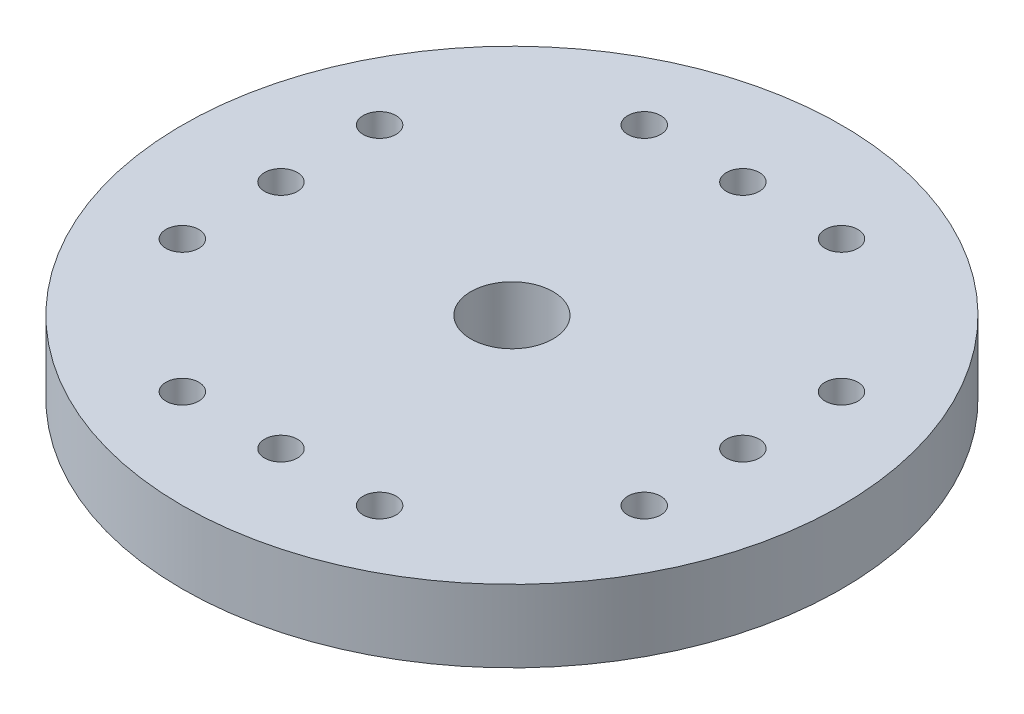
ISO-10303-21;
HEADER;
FILE_DESCRIPTION(('STEP AP214'),'2;1');
FILE_NAME('part.step','',(''),(''),'','','');
FILE_SCHEMA(('AUTOMOTIVE_DESIGN { 1 0 10303 214 1 1 1 1 }'));
ENDSEC;
DATA;
#1=APPLICATION_CONTEXT('core data for automotive mechanical design processes');
#2=APPLICATION_PROTOCOL_DEFINITION('international standard','automotive_design',2000,#1);
#3=PRODUCT_CONTEXT('',#1,'mechanical');
#4=PRODUCT('Part','Part','',(#3));
#5=PRODUCT_RELATED_PRODUCT_CATEGORY('part','',(#4));
#6=PRODUCT_DEFINITION_FORMATION('','',#4);
#7=PRODUCT_DEFINITION_CONTEXT('part definition',#1,'design');
#8=PRODUCT_DEFINITION('design','',#6,#7);
#9=PRODUCT_DEFINITION_SHAPE('','',#8);
#10=(LENGTH_UNIT() NAMED_UNIT(*) SI_UNIT(.MILLI.,.METRE.));
#11=(NAMED_UNIT(*) PLANE_ANGLE_UNIT() SI_UNIT($,.RADIAN.));
#12=(NAMED_UNIT(*) SI_UNIT($,.STERADIAN.) SOLID_ANGLE_UNIT());
#13=UNCERTAINTY_MEASURE_WITH_UNIT(LENGTH_MEASURE(1.E-05),#10,'distance_accuracy_value','');
#14=(GEOMETRIC_REPRESENTATION_CONTEXT(3) GLOBAL_UNCERTAINTY_ASSIGNED_CONTEXT((#13)) GLOBAL_UNIT_ASSIGNED_CONTEXT((#10,
#11,#12)) REPRESENTATION_CONTEXT('',''));
#15=CARTESIAN_POINT('',(0.,0.,0.));
#16=DIRECTION('',(0.,0.,1.));
#17=DIRECTION('',(1.,0.,0.));
#18=AXIS2_PLACEMENT_3D('',#15,#16,#17);
#19=CARTESIAN_POINT('',(0.,2.2,0.));
#20=DIRECTION('',(0.,-1.,0.));
#21=DIRECTION('',(0.,0.,-1.));
#22=AXIS2_PLACEMENT_3D('',#19,#20,#21);
#23=CYLINDRICAL_SURFACE('',#22,10.025);
#24=CARTESIAN_POINT('',(0.,2.2,0.));
#25=DIRECTION('',(0.,1.,0.));
#26=DIRECTION('',(0.,0.,1.));
#27=AXIS2_PLACEMENT_3D('',#24,#25,#26);
#28=CIRCLE('',#27,10.025);
#29=CARTESIAN_POINT('',(0.,2.2,10.025));
#30=VERTEX_POINT('',#29);
#31=EDGE_CURVE('E40',#30,#30,#28,.T.);
#32=ORIENTED_EDGE('',*,*,#31,.F.);
#33=EDGE_LOOP('',(#32));
#34=FACE_BOUND('',#33,.T.);
#35=CARTESIAN_POINT('',(0.,0.,0.));
#36=DIRECTION('',(0.,1.,0.));
#37=DIRECTION('',(0.,0.,1.));
#38=AXIS2_PLACEMENT_3D('',#35,#36,#37);
#39=CIRCLE('',#38,10.025);
#40=CARTESIAN_POINT('',(0.,0.,10.025));
#41=VERTEX_POINT('',#40);
#42=EDGE_CURVE('E44',#41,#41,#39,.T.);
#43=ORIENTED_EDGE('',*,*,#42,.T.);
#44=EDGE_LOOP('',(#43));
#45=FACE_BOUND('',#44,.T.);
#46=ADVANCED_FACE('F34',(#34,#45),#23,.T.);
#47=CARTESIAN_POINT('',(0.,2.2,0.));
#48=DIRECTION('',(0.,1.,0.));
#49=DIRECTION('',(0.,0.,1.));
#50=AXIS2_PLACEMENT_3D('',#47,#48,#49);
#51=PLANE('',#50);
#52=CARTESIAN_POINT('',(0.,2.2,0.));
#53=DIRECTION('',(0.,-1.,0.));
#54=DIRECTION('',(0.,0.,-1.));
#55=AXIS2_PLACEMENT_3D('',#52,#53,#54);
#56=CIRCLE('',#55,1.25);
#57=CARTESIAN_POINT('',(0.,2.2,-1.25));
#58=VERTEX_POINT('',#57);
#59=EDGE_CURVE('E129',#58,#58,#56,.T.);
#60=ORIENTED_EDGE('',*,*,#59,.T.);
#61=EDGE_LOOP('',(#60));
#62=FACE_BOUND('',#61,.T.);
#63=CARTESIAN_POINT('',(-3.00000000000007,2.2,-7.02499999999997));
#64=DIRECTION('',(0.,-1.,0.));
#65=DIRECTION('',(0.,0.,-1.));
#66=AXIS2_PLACEMENT_3D('',#63,#64,#65);
#67=CIRCLE('',#66,0.5);
#68=CARTESIAN_POINT('',(-3.00000000000007,2.2,-7.52499999999997));
#69=VERTEX_POINT('',#68);
#70=EDGE_CURVE('E60',#69,#69,#67,.T.);
#71=ORIENTED_EDGE('',*,*,#70,.T.);
#72=EDGE_LOOP('',(#71));
#73=FACE_BOUND('',#72,.T.);
#74=CARTESIAN_POINT('',(0.,2.2,-7.025));
#75=DIRECTION('',(0.,-1.,0.));
#76=DIRECTION('',(0.,0.,-1.));
#77=AXIS2_PLACEMENT_3D('',#74,#75,#76);
#78=CIRCLE('',#77,0.5);
#79=CARTESIAN_POINT('',(0.,2.2,-7.525));
#80=VERTEX_POINT('',#79);
#81=EDGE_CURVE('E67',#80,#80,#78,.T.);
#82=ORIENTED_EDGE('',*,*,#81,.T.);
#83=EDGE_LOOP('',(#82));
#84=FACE_BOUND('',#83,.T.);
#85=CARTESIAN_POINT('',(2.99999999999993,2.2,-7.02500000000003));
#86=DIRECTION('',(0.,-1.,0.));
#87=DIRECTION('',(0.,0.,-1.));
#88=AXIS2_PLACEMENT_3D('',#85,#86,#87);
#89=CIRCLE('',#88,0.5);
#90=CARTESIAN_POINT('',(2.99999999999993,2.2,-7.52500000000003));
#91=VERTEX_POINT('',#90);
#92=EDGE_CURVE('E73',#91,#91,#89,.T.);
#93=ORIENTED_EDGE('',*,*,#92,.T.);
#94=EDGE_LOOP('',(#93));
#95=FACE_BOUND('',#94,.T.);
#96=CARTESIAN_POINT('',(7.02499999999998,2.2,-3.00000000000005));
#97=DIRECTION('',(0.,-1.,0.));
#98=DIRECTION('',(0.,0.,-1.));
#99=AXIS2_PLACEMENT_3D('',#96,#97,#98);
#100=CIRCLE('',#99,0.500000000000001);
#101=CARTESIAN_POINT('',(7.02499999999998,2.2,-3.50000000000005));
#102=VERTEX_POINT('',#101);
#103=EDGE_CURVE('E79',#102,#102,#100,.T.);
#104=ORIENTED_EDGE('',*,*,#103,.T.);
#105=EDGE_LOOP('',(#104));
#106=FACE_BOUND('',#105,.T.);
#107=CARTESIAN_POINT('',(7.025,2.2,0.));
#108=DIRECTION('',(0.,-1.,0.));
#109=DIRECTION('',(0.,0.,-1.));
#110=AXIS2_PLACEMENT_3D('',#107,#108,#109);
#111=CIRCLE('',#110,0.5);
#112=CARTESIAN_POINT('',(7.025,2.2,-0.500000000000048));
#113=VERTEX_POINT('',#112);
#114=EDGE_CURVE('E85',#113,#113,#111,.T.);
#115=ORIENTED_EDGE('',*,*,#114,.T.);
#116=EDGE_LOOP('',(#115));
#117=FACE_BOUND('',#116,.T.);
#118=CARTESIAN_POINT('',(7.02500000000002,2.2,2.99999999999995));
#119=DIRECTION('',(0.,-1.,0.));
#120=DIRECTION('',(0.,0.,-1.));
#121=AXIS2_PLACEMENT_3D('',#118,#119,#120);
#122=CIRCLE('',#121,0.5);
#123=CARTESIAN_POINT('',(7.02500000000002,2.2,2.49999999999995));
#124=VERTEX_POINT('',#123);
#125=EDGE_CURVE('E91',#124,#124,#122,.T.);
#126=ORIENTED_EDGE('',*,*,#125,.T.);
#127=EDGE_LOOP('',(#126));
#128=FACE_BOUND('',#127,.T.);
#129=CARTESIAN_POINT('',(3.00000000000003,2.2,7.02499999999999));
#130=DIRECTION('',(0.,-1.,0.));
#131=DIRECTION('',(0.,0.,-1.));
#132=AXIS2_PLACEMENT_3D('',#129,#130,#131);
#133=CIRCLE('',#132,0.5);
#134=CARTESIAN_POINT('',(3.00000000000003,2.2,6.52499999999999));
#135=VERTEX_POINT('',#134);
#136=EDGE_CURVE('E97',#135,#135,#133,.T.);
#137=ORIENTED_EDGE('',*,*,#136,.T.);
#138=EDGE_LOOP('',(#137));
#139=FACE_BOUND('',#138,.T.);
#140=CARTESIAN_POINT('',(0.,2.2,7.025));
#141=DIRECTION('',(0.,-1.,0.));
#142=DIRECTION('',(0.,0.,-1.));
#143=AXIS2_PLACEMENT_3D('',#140,#141,#142);
#144=CIRCLE('',#143,0.5);
#145=CARTESIAN_POINT('',(0.,2.2,6.525));
#146=VERTEX_POINT('',#145);
#147=EDGE_CURVE('E103',#146,#146,#144,.T.);
#148=ORIENTED_EDGE('',*,*,#147,.T.);
#149=EDGE_LOOP('',(#148));
#150=FACE_BOUND('',#149,.T.);
#151=CARTESIAN_POINT('',(-2.99999999999998,2.2,7.02500000000001));
#152=DIRECTION('',(0.,-1.,0.));
#153=DIRECTION('',(0.,0.,-1.));
#154=AXIS2_PLACEMENT_3D('',#151,#152,#153);
#155=CIRCLE('',#154,0.5);
#156=CARTESIAN_POINT('',(-2.99999999999998,2.2,6.52500000000001));
#157=VERTEX_POINT('',#156);
#158=EDGE_CURVE('E109',#157,#157,#155,.T.);
#159=ORIENTED_EDGE('',*,*,#158,.T.);
#160=EDGE_LOOP('',(#159));
#161=FACE_BOUND('',#160,.T.);
#162=CARTESIAN_POINT('',(-7.025,2.2,3.));
#163=DIRECTION('',(0.,-1.,0.));
#164=DIRECTION('',(0.,0.,-1.));
#165=AXIS2_PLACEMENT_3D('',#162,#163,#164);
#166=CIRCLE('',#165,0.500000000000001);
#167=CARTESIAN_POINT('',(-7.025,2.2,2.5));
#168=VERTEX_POINT('',#167);
#169=EDGE_CURVE('E115',#168,#168,#166,.T.);
#170=ORIENTED_EDGE('',*,*,#169,.T.);
#171=EDGE_LOOP('',(#170));
#172=FACE_BOUND('',#171,.T.);
#173=CARTESIAN_POINT('',(-7.025,2.2,0.));
#174=DIRECTION('',(0.,-1.,0.));
#175=DIRECTION('',(0.,0.,-1.));
#176=AXIS2_PLACEMENT_3D('',#173,#174,#175);
#177=CIRCLE('',#176,0.5);
#178=CARTESIAN_POINT('',(-7.025,2.2,-0.5));
#179=VERTEX_POINT('',#178);
#180=EDGE_CURVE('E54',#179,#179,#177,.T.);
#181=ORIENTED_EDGE('',*,*,#180,.T.);
#182=EDGE_LOOP('',(#181));
#183=FACE_BOUND('',#182,.T.);
#184=CARTESIAN_POINT('',(-7.025,2.2,-3.));
#185=DIRECTION('',(0.,-1.,0.));
#186=DIRECTION('',(0.,0.,-1.));
#187=AXIS2_PLACEMENT_3D('',#184,#185,#186);
#188=CIRCLE('',#187,0.5);
#189=CARTESIAN_POINT('',(-7.025,2.2,-3.5));
#190=VERTEX_POINT('',#189);
#191=EDGE_CURVE('E49',#190,#190,#188,.T.);
#192=ORIENTED_EDGE('',*,*,#191,.T.);
#193=EDGE_LOOP('',(#192));
#194=FACE_BOUND('',#193,.T.);
#195=ORIENTED_EDGE('',*,*,#31,.T.);
#196=EDGE_LOOP('',(#195));
#197=FACE_BOUND('',#196,.T.);
#198=ADVANCED_FACE('F138',(#62,#73,#84,#95,#106,#117,#128,#139,#150,#161,#172,#183,#194,#197),
#51,.T.);
#199=CARTESIAN_POINT('',(0.,0.,0.));
#200=DIRECTION('',(0.,1.,0.));
#201=DIRECTION('',(0.,0.,1.));
#202=AXIS2_PLACEMENT_3D('',#199,#200,#201);
#203=PLANE('',#202);
#204=CARTESIAN_POINT('',(0.,0.,0.));
#205=DIRECTION('',(0.,1.,0.));
#206=DIRECTION('',(0.,0.,1.));
#207=AXIS2_PLACEMENT_3D('',#204,#205,#206);
#208=CIRCLE('',#207,3.8);
#209=CARTESIAN_POINT('',(0.,0.,3.8));
#210=VERTEX_POINT('',#209);
#211=EDGE_CURVE('E10',#210,#210,#208,.F.);
#212=ORIENTED_EDGE('',*,*,#211,.F.);
#213=EDGE_LOOP('',(#212));
#214=FACE_BOUND('',#213,.T.);
#215=CARTESIAN_POINT('',(-3.00000000000007,0.,-7.02499999999997));
#216=DIRECTION('',(0.,-1.,0.));
#217=DIRECTION('',(0.,0.,-1.));
#218=AXIS2_PLACEMENT_3D('',#215,#216,#217);
#219=CIRCLE('',#218,0.5);
#220=CARTESIAN_POINT('',(-3.00000000000007,0.,-7.52499999999997));
#221=VERTEX_POINT('',#220);
#222=EDGE_CURVE('E57',#221,#221,#219,.T.);
#223=ORIENTED_EDGE('',*,*,#222,.F.);
#224=EDGE_LOOP('',(#223));
#225=FACE_BOUND('',#224,.T.);
#226=CARTESIAN_POINT('',(0.,0.,-7.025));
#227=DIRECTION('',(0.,-1.,0.));
#228=DIRECTION('',(0.,0.,-1.));
#229=AXIS2_PLACEMENT_3D('',#226,#227,#228);
#230=CIRCLE('',#229,0.5);
#231=CARTESIAN_POINT('',(0.,0.,-7.525));
#232=VERTEX_POINT('',#231);
#233=EDGE_CURVE('E64',#232,#232,#230,.T.);
#234=ORIENTED_EDGE('',*,*,#233,.F.);
#235=EDGE_LOOP('',(#234));
#236=FACE_BOUND('',#235,.T.);
#237=CARTESIAN_POINT('',(2.99999999999993,0.,-7.02500000000003));
#238=DIRECTION('',(0.,-1.,0.));
#239=DIRECTION('',(0.,0.,-1.));
#240=AXIS2_PLACEMENT_3D('',#237,#238,#239);
#241=CIRCLE('',#240,0.5);
#242=CARTESIAN_POINT('',(2.99999999999993,0.,-7.52500000000003));
#243=VERTEX_POINT('',#242);
#244=EDGE_CURVE('E70',#243,#243,#241,.T.);
#245=ORIENTED_EDGE('',*,*,#244,.F.);
#246=EDGE_LOOP('',(#245));
#247=FACE_BOUND('',#246,.T.);
#248=CARTESIAN_POINT('',(7.02499999999998,0.,-3.00000000000005));
#249=DIRECTION('',(0.,-1.,0.));
#250=DIRECTION('',(0.,0.,-1.));
#251=AXIS2_PLACEMENT_3D('',#248,#249,#250);
#252=CIRCLE('',#251,0.500000000000001);
#253=CARTESIAN_POINT('',(7.02499999999998,0.,-3.50000000000005));
#254=VERTEX_POINT('',#253);
#255=EDGE_CURVE('E76',#254,#254,#252,.T.);
#256=ORIENTED_EDGE('',*,*,#255,.F.);
#257=EDGE_LOOP('',(#256));
#258=FACE_BOUND('',#257,.T.);
#259=CARTESIAN_POINT('',(7.025,0.,0.));
#260=DIRECTION('',(0.,-1.,0.));
#261=DIRECTION('',(0.,0.,-1.));
#262=AXIS2_PLACEMENT_3D('',#259,#260,#261);
#263=CIRCLE('',#262,0.5);
#264=CARTESIAN_POINT('',(7.025,0.,-0.500000000000048));
#265=VERTEX_POINT('',#264);
#266=EDGE_CURVE('E82',#265,#265,#263,.T.);
#267=ORIENTED_EDGE('',*,*,#266,.F.);
#268=EDGE_LOOP('',(#267));
#269=FACE_BOUND('',#268,.T.);
#270=CARTESIAN_POINT('',(7.02500000000002,0.,2.99999999999995));
#271=DIRECTION('',(0.,-1.,0.));
#272=DIRECTION('',(0.,0.,-1.));
#273=AXIS2_PLACEMENT_3D('',#270,#271,#272);
#274=CIRCLE('',#273,0.5);
#275=CARTESIAN_POINT('',(7.02500000000002,0.,2.49999999999995));
#276=VERTEX_POINT('',#275);
#277=EDGE_CURVE('E88',#276,#276,#274,.T.);
#278=ORIENTED_EDGE('',*,*,#277,.F.);
#279=EDGE_LOOP('',(#278));
#280=FACE_BOUND('',#279,.T.);
#281=CARTESIAN_POINT('',(3.00000000000003,0.,7.02499999999999));
#282=DIRECTION('',(0.,-1.,0.));
#283=DIRECTION('',(0.,0.,-1.));
#284=AXIS2_PLACEMENT_3D('',#281,#282,#283);
#285=CIRCLE('',#284,0.5);
#286=CARTESIAN_POINT('',(3.00000000000003,0.,6.52499999999999));
#287=VERTEX_POINT('',#286);
#288=EDGE_CURVE('E94',#287,#287,#285,.T.);
#289=ORIENTED_EDGE('',*,*,#288,.F.);
#290=EDGE_LOOP('',(#289));
#291=FACE_BOUND('',#290,.T.);
#292=CARTESIAN_POINT('',(0.,0.,7.025));
#293=DIRECTION('',(0.,-1.,0.));
#294=DIRECTION('',(0.,0.,-1.));
#295=AXIS2_PLACEMENT_3D('',#292,#293,#294);
#296=CIRCLE('',#295,0.5);
#297=CARTESIAN_POINT('',(0.,0.,6.525));
#298=VERTEX_POINT('',#297);
#299=EDGE_CURVE('E100',#298,#298,#296,.T.);
#300=ORIENTED_EDGE('',*,*,#299,.F.);
#301=EDGE_LOOP('',(#300));
#302=FACE_BOUND('',#301,.T.);
#303=CARTESIAN_POINT('',(-2.99999999999998,0.,7.02500000000001));
#304=DIRECTION('',(0.,-1.,0.));
#305=DIRECTION('',(0.,0.,-1.));
#306=AXIS2_PLACEMENT_3D('',#303,#304,#305);
#307=CIRCLE('',#306,0.5);
#308=CARTESIAN_POINT('',(-2.99999999999998,0.,6.52500000000001));
#309=VERTEX_POINT('',#308);
#310=EDGE_CURVE('E106',#309,#309,#307,.T.);
#311=ORIENTED_EDGE('',*,*,#310,.F.);
#312=EDGE_LOOP('',(#311));
#313=FACE_BOUND('',#312,.T.);
#314=CARTESIAN_POINT('',(-7.025,0.,3.));
#315=DIRECTION('',(0.,-1.,0.));
#316=DIRECTION('',(0.,0.,-1.));
#317=AXIS2_PLACEMENT_3D('',#314,#315,#316);
#318=CIRCLE('',#317,0.500000000000001);
#319=CARTESIAN_POINT('',(-7.025,0.,2.5));
#320=VERTEX_POINT('',#319);
#321=EDGE_CURVE('E112',#320,#320,#318,.T.);
#322=ORIENTED_EDGE('',*,*,#321,.F.);
#323=EDGE_LOOP('',(#322));
#324=FACE_BOUND('',#323,.T.);
#325=CARTESIAN_POINT('',(-7.025,0.,0.));
#326=DIRECTION('',(0.,-1.,0.));
#327=DIRECTION('',(0.,0.,-1.));
#328=AXIS2_PLACEMENT_3D('',#325,#326,#327);
#329=CIRCLE('',#328,0.5);
#330=CARTESIAN_POINT('',(-7.025,0.,-0.5));
#331=VERTEX_POINT('',#330);
#332=EDGE_CURVE('E118',#331,#331,#329,.T.);
#333=ORIENTED_EDGE('',*,*,#332,.F.);
#334=EDGE_LOOP('',(#333));
#335=FACE_BOUND('',#334,.T.);
#336=CARTESIAN_POINT('',(-7.025,0.,-3.));
#337=DIRECTION('',(0.,-1.,0.));
#338=DIRECTION('',(0.,0.,-1.));
#339=AXIS2_PLACEMENT_3D('',#336,#337,#338);
#340=CIRCLE('',#339,0.5);
#341=CARTESIAN_POINT('',(-7.025,0.,-3.5));
#342=VERTEX_POINT('',#341);
#343=EDGE_CURVE('E51',#342,#342,#340,.T.);
#344=ORIENTED_EDGE('',*,*,#343,.F.);
#345=EDGE_LOOP('',(#344));
#346=FACE_BOUND('',#345,.T.);
#347=ORIENTED_EDGE('',*,*,#42,.F.);
#348=EDGE_LOOP('',(#347));
#349=FACE_BOUND('',#348,.T.);
#350=ADVANCED_FACE('F181',(#214,#225,#236,#247,#258,#269,#280,#291,#302,#313,#324,#335,#346,
#349),#203,.F.);
#351=CARTESIAN_POINT('',(-7.025,2.2,-3.));
#352=DIRECTION('',(0.,-1.,0.));
#353=DIRECTION('',(0.,0.,-1.));
#354=AXIS2_PLACEMENT_3D('',#351,#352,#353);
#355=CYLINDRICAL_SURFACE('',#354,0.5);
#356=ORIENTED_EDGE('',*,*,#191,.F.);
#357=EDGE_LOOP('',(#356));
#358=FACE_BOUND('',#357,.T.);
#359=ORIENTED_EDGE('',*,*,#343,.T.);
#360=EDGE_LOOP('',(#359));
#361=FACE_BOUND('',#360,.T.);
#362=ADVANCED_FACE('F187',(#358,#361),#355,.F.);
#363=CARTESIAN_POINT('',(-7.025,2.2,0.));
#364=DIRECTION('',(0.,-1.,0.));
#365=DIRECTION('',(0.,0.,-1.));
#366=AXIS2_PLACEMENT_3D('',#363,#364,#365);
#367=CYLINDRICAL_SURFACE('',#366,0.5);
#368=ORIENTED_EDGE('',*,*,#180,.F.);
#369=EDGE_LOOP('',(#368));
#370=FACE_BOUND('',#369,.T.);
#371=ORIENTED_EDGE('',*,*,#332,.T.);
#372=EDGE_LOOP('',(#371));
#373=FACE_BOUND('',#372,.T.);
#374=ADVANCED_FACE('F192',(#370,#373),#367,.F.);
#375=CARTESIAN_POINT('',(-7.025,2.2,3.));
#376=DIRECTION('',(0.,-1.,0.));
#377=DIRECTION('',(0.,0.,-1.));
#378=AXIS2_PLACEMENT_3D('',#375,#376,#377);
#379=CYLINDRICAL_SURFACE('',#378,0.500000000000001);
#380=ORIENTED_EDGE('',*,*,#169,.F.);
#381=EDGE_LOOP('',(#380));
#382=FACE_BOUND('',#381,.T.);
#383=ORIENTED_EDGE('',*,*,#321,.T.);
#384=EDGE_LOOP('',(#383));
#385=FACE_BOUND('',#384,.T.);
#386=ADVANCED_FACE('F227',(#382,#385),#379,.F.);
#387=CARTESIAN_POINT('',(-2.99999999999998,2.2,7.02500000000001));
#388=DIRECTION('',(0.,-1.,0.));
#389=DIRECTION('',(0.,0.,-1.));
#390=AXIS2_PLACEMENT_3D('',#387,#388,#389);
#391=CYLINDRICAL_SURFACE('',#390,0.5);
#392=ORIENTED_EDGE('',*,*,#158,.F.);
#393=EDGE_LOOP('',(#392));
#394=FACE_BOUND('',#393,.T.);
#395=ORIENTED_EDGE('',*,*,#310,.T.);
#396=EDGE_LOOP('',(#395));
#397=FACE_BOUND('',#396,.T.);
#398=ADVANCED_FACE('F223',(#394,#397),#391,.F.);
#399=CARTESIAN_POINT('',(0.,2.2,7.025));
#400=DIRECTION('',(0.,-1.,0.));
#401=DIRECTION('',(0.,0.,-1.));
#402=AXIS2_PLACEMENT_3D('',#399,#400,#401);
#403=CYLINDRICAL_SURFACE('',#402,0.5);
#404=ORIENTED_EDGE('',*,*,#147,.F.);
#405=EDGE_LOOP('',(#404));
#406=FACE_BOUND('',#405,.T.);
#407=ORIENTED_EDGE('',*,*,#299,.T.);
#408=EDGE_LOOP('',(#407));
#409=FACE_BOUND('',#408,.T.);
#410=ADVANCED_FACE('F219',(#406,#409),#403,.F.);
#411=CARTESIAN_POINT('',(3.00000000000003,2.2,7.02499999999999));
#412=DIRECTION('',(0.,-1.,0.));
#413=DIRECTION('',(0.,0.,-1.));
#414=AXIS2_PLACEMENT_3D('',#411,#412,#413);
#415=CYLINDRICAL_SURFACE('',#414,0.5);
#416=ORIENTED_EDGE('',*,*,#136,.F.);
#417=EDGE_LOOP('',(#416));
#418=FACE_BOUND('',#417,.T.);
#419=ORIENTED_EDGE('',*,*,#288,.T.);
#420=EDGE_LOOP('',(#419));
#421=FACE_BOUND('',#420,.T.);
#422=ADVANCED_FACE('F215',(#418,#421),#415,.F.);
#423=CARTESIAN_POINT('',(7.02500000000002,2.2,2.99999999999995));
#424=DIRECTION('',(0.,-1.,0.));
#425=DIRECTION('',(0.,0.,-1.));
#426=AXIS2_PLACEMENT_3D('',#423,#424,#425);
#427=CYLINDRICAL_SURFACE('',#426,0.5);
#428=ORIENTED_EDGE('',*,*,#125,.F.);
#429=EDGE_LOOP('',(#428));
#430=FACE_BOUND('',#429,.T.);
#431=ORIENTED_EDGE('',*,*,#277,.T.);
#432=EDGE_LOOP('',(#431));
#433=FACE_BOUND('',#432,.T.);
#434=ADVANCED_FACE('F211',(#430,#433),#427,.F.);
#435=CARTESIAN_POINT('',(7.025,2.2,0.));
#436=DIRECTION('',(0.,-1.,0.));
#437=DIRECTION('',(0.,0.,-1.));
#438=AXIS2_PLACEMENT_3D('',#435,#436,#437);
#439=CYLINDRICAL_SURFACE('',#438,0.5);
#440=ORIENTED_EDGE('',*,*,#114,.F.);
#441=EDGE_LOOP('',(#440));
#442=FACE_BOUND('',#441,.T.);
#443=ORIENTED_EDGE('',*,*,#266,.T.);
#444=EDGE_LOOP('',(#443));
#445=FACE_BOUND('',#444,.T.);
#446=ADVANCED_FACE('F207',(#442,#445),#439,.F.);
#447=CARTESIAN_POINT('',(7.02499999999998,2.2,-3.00000000000005));
#448=DIRECTION('',(0.,-1.,0.));
#449=DIRECTION('',(0.,0.,-1.));
#450=AXIS2_PLACEMENT_3D('',#447,#448,#449);
#451=CYLINDRICAL_SURFACE('',#450,0.500000000000001);
#452=ORIENTED_EDGE('',*,*,#103,.F.);
#453=EDGE_LOOP('',(#452));
#454=FACE_BOUND('',#453,.T.);
#455=ORIENTED_EDGE('',*,*,#255,.T.);
#456=EDGE_LOOP('',(#455));
#457=FACE_BOUND('',#456,.T.);
#458=ADVANCED_FACE('F203',(#454,#457),#451,.F.);
#459=CARTESIAN_POINT('',(2.99999999999993,2.2,-7.02500000000003));
#460=DIRECTION('',(0.,-1.,0.));
#461=DIRECTION('',(0.,0.,-1.));
#462=AXIS2_PLACEMENT_3D('',#459,#460,#461);
#463=CYLINDRICAL_SURFACE('',#462,0.5);
#464=ORIENTED_EDGE('',*,*,#92,.F.);
#465=EDGE_LOOP('',(#464));
#466=FACE_BOUND('',#465,.T.);
#467=ORIENTED_EDGE('',*,*,#244,.T.);
#468=EDGE_LOOP('',(#467));
#469=FACE_BOUND('',#468,.T.);
#470=ADVANCED_FACE('F199',(#466,#469),#463,.F.);
#471=CARTESIAN_POINT('',(0.,2.2,-7.025));
#472=DIRECTION('',(0.,-1.,0.));
#473=DIRECTION('',(0.,0.,-1.));
#474=AXIS2_PLACEMENT_3D('',#471,#472,#473);
#475=CYLINDRICAL_SURFACE('',#474,0.5);
#476=ORIENTED_EDGE('',*,*,#81,.F.);
#477=EDGE_LOOP('',(#476));
#478=FACE_BOUND('',#477,.T.);
#479=ORIENTED_EDGE('',*,*,#233,.T.);
#480=EDGE_LOOP('',(#479));
#481=FACE_BOUND('',#480,.T.);
#482=ADVANCED_FACE('F172',(#478,#481),#475,.F.);
#483=CARTESIAN_POINT('',(-3.00000000000007,2.2,-7.02499999999997));
#484=DIRECTION('',(0.,-1.,0.));
#485=DIRECTION('',(0.,0.,-1.));
#486=AXIS2_PLACEMENT_3D('',#483,#484,#485);
#487=CYLINDRICAL_SURFACE('',#486,0.5);
#488=ORIENTED_EDGE('',*,*,#70,.F.);
#489=EDGE_LOOP('',(#488));
#490=FACE_BOUND('',#489,.T.);
#491=ORIENTED_EDGE('',*,*,#222,.T.);
#492=EDGE_LOOP('',(#491));
#493=FACE_BOUND('',#492,.T.);
#494=ADVANCED_FACE('F167',(#490,#493),#487,.F.);
#495=CARTESIAN_POINT('',(0.,-3.4,0.));
#496=DIRECTION('',(0.,1.,0.));
#497=DIRECTION('',(0.,0.,1.));
#498=AXIS2_PLACEMENT_3D('',#495,#496,#497);
#499=CYLINDRICAL_SURFACE('',#498,3.8);
#500=CARTESIAN_POINT('',(0.,-3.4,0.));
#501=DIRECTION('',(0.,-1.,0.));
#502=DIRECTION('',(0.,0.,-1.));
#503=AXIS2_PLACEMENT_3D('',#500,#501,#502);
#504=CIRCLE('',#503,3.8);
#505=CARTESIAN_POINT('',(0.,-3.4,-3.8));
#506=VERTEX_POINT('',#505);
#507=EDGE_CURVE('E61',#506,#506,#504,.T.);
#508=ORIENTED_EDGE('',*,*,#507,.F.);
#509=EDGE_LOOP('',(#508));
#510=FACE_BOUND('',#509,.T.);
#511=ORIENTED_EDGE('',*,*,#211,.T.);
#512=EDGE_LOOP('',(#511));
#513=FACE_BOUND('',#512,.T.);
#514=ADVANCED_FACE('F162',(#510,#513),#499,.T.);
#515=CARTESIAN_POINT('',(0.,-3.4,0.));
#516=DIRECTION('',(0.,-1.,0.));
#517=DIRECTION('',(0.,0.,-1.));
#518=AXIS2_PLACEMENT_3D('',#515,#516,#517);
#519=PLANE('',#518);
#520=CARTESIAN_POINT('',(0.,-3.4,0.));
#521=DIRECTION('',(0.,-1.,0.));
#522=DIRECTION('',(0.,0.,-1.));
#523=AXIS2_PLACEMENT_3D('',#520,#521,#522);
#524=CIRCLE('',#523,3.);
#525=CARTESIAN_POINT('',(0.,-3.4,-3.));
#526=VERTEX_POINT('',#525);
#527=EDGE_CURVE('E126',#526,#526,#524,.T.);
#528=ORIENTED_EDGE('',*,*,#527,.F.);
#529=EDGE_LOOP('',(#528));
#530=FACE_BOUND('',#529,.T.);
#531=ORIENTED_EDGE('',*,*,#507,.T.);
#532=EDGE_LOOP('',(#531));
#533=FACE_BOUND('',#532,.T.);
#534=ADVANCED_FACE('F156',(#530,#533),#519,.T.);
#535=CARTESIAN_POINT('',(0.,-0.6,0.));
#536=DIRECTION('',(0.,-1.,0.));
#537=DIRECTION('',(0.,0.,-1.));
#538=AXIS2_PLACEMENT_3D('',#535,#536,#537);
#539=CYLINDRICAL_SURFACE('',#538,3.);
#540=CARTESIAN_POINT('',(0.,-0.6,0.));
#541=DIRECTION('',(0.,-1.,0.));
#542=DIRECTION('',(0.,0.,-1.));
#543=AXIS2_PLACEMENT_3D('',#540,#541,#542);
#544=CIRCLE('',#543,3.);
#545=CARTESIAN_POINT('',(0.,-0.6,-3.));
#546=VERTEX_POINT('',#545);
#547=EDGE_CURVE('E125',#546,#546,#544,.T.);
#548=ORIENTED_EDGE('',*,*,#547,.F.);
#549=EDGE_LOOP('',(#548));
#550=FACE_BOUND('',#549,.T.);
#551=ORIENTED_EDGE('',*,*,#527,.T.);
#552=EDGE_LOOP('',(#551));
#553=FACE_BOUND('',#552,.T.);
#554=ADVANCED_FACE('F150',(#550,#553),#539,.F.);
#555=CARTESIAN_POINT('',(0.,-0.6,0.));
#556=DIRECTION('',(0.,-1.,0.));
#557=DIRECTION('',(0.,0.,-1.));
#558=AXIS2_PLACEMENT_3D('',#555,#556,#557);
#559=PLANE('',#558);
#560=CARTESIAN_POINT('',(0.,-0.6,0.));
#561=DIRECTION('',(0.,-1.,0.));
#562=DIRECTION('',(0.,0.,-1.));
#563=AXIS2_PLACEMENT_3D('',#560,#561,#562);
#564=CIRCLE('',#563,1.25);
#565=CARTESIAN_POINT('',(0.,-0.6,-1.25));
#566=VERTEX_POINT('',#565);
#567=EDGE_CURVE('E132',#566,#566,#564,.T.);
#568=ORIENTED_EDGE('',*,*,#567,.F.);
#569=EDGE_LOOP('',(#568));
#570=FACE_BOUND('',#569,.T.);
#571=ORIENTED_EDGE('',*,*,#547,.T.);
#572=EDGE_LOOP('',(#571));
#573=FACE_BOUND('',#572,.T.);
#574=ADVANCED_FACE('F144',(#570,#573),#559,.T.);
#575=CARTESIAN_POINT('',(0.,2.2,0.));
#576=DIRECTION('',(0.,-1.,0.));
#577=DIRECTION('',(0.,0.,-1.));
#578=AXIS2_PLACEMENT_3D('',#575,#576,#577);
#579=CYLINDRICAL_SURFACE('',#578,1.25);
#580=ORIENTED_EDGE('',*,*,#59,.F.);
#581=EDGE_LOOP('',(#580));
#582=FACE_BOUND('',#581,.T.);
#583=ORIENTED_EDGE('',*,*,#567,.T.);
#584=EDGE_LOOP('',(#583));
#585=FACE_BOUND('',#584,.T.);
#586=ADVANCED_FACE('F141',(#582,#585),#579,.F.);
#587=CLOSED_SHELL('',(#46,#198,#350,#362,#374,#386,#398,#410,#422,#434,#446,#458,#470,#482,#494,
#514,#534,#554,#574,#586));
#588=MANIFOLD_SOLID_BREP('B2',#587);
#589=ADVANCED_BREP_SHAPE_REPRESENTATION('',(#18,#588),#14);
#590=SHAPE_DEFINITION_REPRESENTATION(#9,#589);
ENDSEC;
END-ISO-10303-21;
